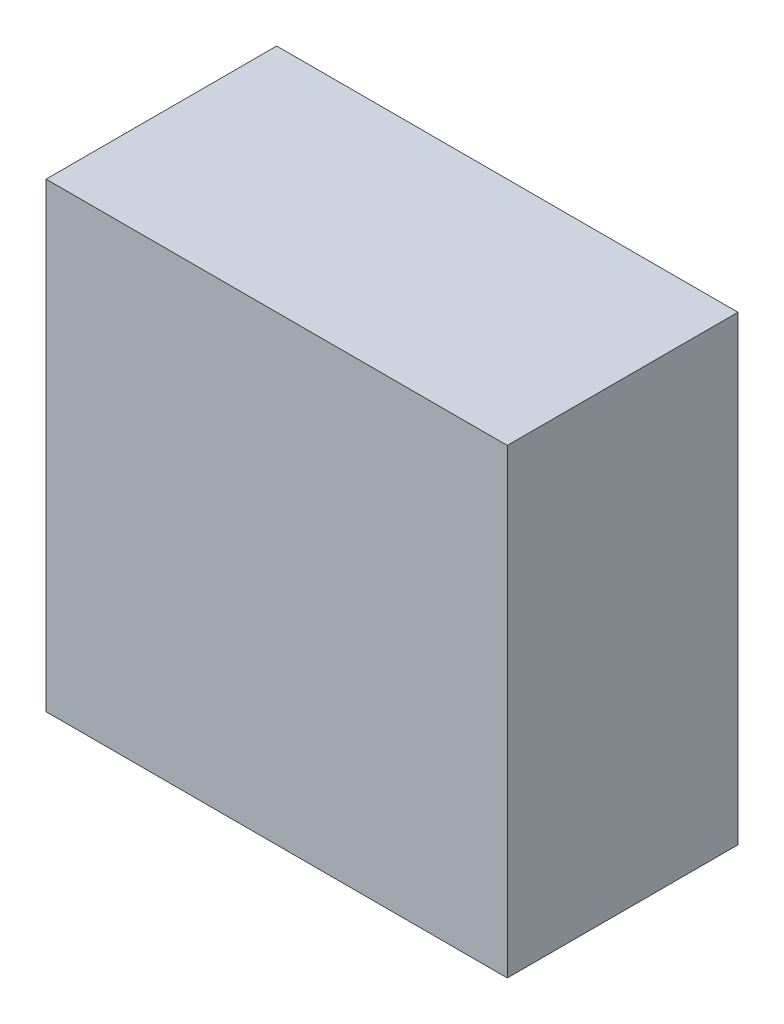
ISO-10303-21;
HEADER;
FILE_DESCRIPTION(('STEP AP214'),'2;1');
FILE_NAME('part.step','',(''),(''),'','','');
FILE_SCHEMA(('AUTOMOTIVE_DESIGN { 1 0 10303 214 1 1 1 1 }'));
ENDSEC;
DATA;
#1=APPLICATION_CONTEXT('core data for automotive mechanical design processes');
#2=APPLICATION_PROTOCOL_DEFINITION('international standard','automotive_design',2000,#1);
#3=PRODUCT_CONTEXT('',#1,'mechanical');
#4=PRODUCT('Part','Part','',(#3));
#5=PRODUCT_RELATED_PRODUCT_CATEGORY('part','',(#4));
#6=PRODUCT_DEFINITION_FORMATION('','',#4);
#7=PRODUCT_DEFINITION_CONTEXT('part definition',#1,'design');
#8=PRODUCT_DEFINITION('design','',#6,#7);
#9=PRODUCT_DEFINITION_SHAPE('','',#8);
#10=(LENGTH_UNIT() NAMED_UNIT(*) SI_UNIT(.MILLI.,.METRE.));
#11=(NAMED_UNIT(*) PLANE_ANGLE_UNIT() SI_UNIT($,.RADIAN.));
#12=(NAMED_UNIT(*) SI_UNIT($,.STERADIAN.) SOLID_ANGLE_UNIT());
#13=UNCERTAINTY_MEASURE_WITH_UNIT(LENGTH_MEASURE(1.E-05),#10,'distance_accuracy_value','');
#14=(GEOMETRIC_REPRESENTATION_CONTEXT(3) GLOBAL_UNCERTAINTY_ASSIGNED_CONTEXT((#13)) GLOBAL_UNIT_ASSIGNED_CONTEXT((#10,
#11,#12)) REPRESENTATION_CONTEXT('',''));
#15=CARTESIAN_POINT('',(0.,0.,0.));
#16=DIRECTION('',(0.,0.,1.));
#17=DIRECTION('',(1.,0.,0.));
#18=AXIS2_PLACEMENT_3D('',#15,#16,#17);
#19=CARTESIAN_POINT('',(-63.5,-63.5,0.));
#20=DIRECTION('',(0.,0.,-1.));
#21=DIRECTION('',(-1.,0.,0.));
#22=AXIS2_PLACEMENT_3D('',#19,#20,#21);
#23=PLANE('',#22);
#24=DIRECTION('',(0.,-1.,0.));
#25=VECTOR('',#24,1.);
#26=CARTESIAN_POINT('',(-63.5,63.5,0.));
#27=LINE('',#26,#25);
#28=CARTESIAN_POINT('',(-63.5,63.5,0.));
#29=VERTEX_POINT('',#28);
#30=CARTESIAN_POINT('',(-63.5,-63.5,0.));
#31=VERTEX_POINT('',#30);
#32=EDGE_CURVE('E97',#29,#31,#27,.T.);
#33=ORIENTED_EDGE('',*,*,#32,.F.);
#34=DIRECTION('',(-1.,0.,0.));
#35=VECTOR('',#34,1.);
#36=CARTESIAN_POINT('',(63.5,63.5,0.));
#37=LINE('',#36,#35);
#38=CARTESIAN_POINT('',(63.5,63.5,0.));
#39=VERTEX_POINT('',#38);
#40=EDGE_CURVE('E73',#39,#29,#37,.T.);
#41=ORIENTED_EDGE('',*,*,#40,.F.);
#42=DIRECTION('',(0.,1.,0.));
#43=VECTOR('',#42,1.);
#44=CARTESIAN_POINT('',(63.5,63.5,0.));
#45=LINE('',#44,#43);
#46=CARTESIAN_POINT('',(63.5,-63.5,0.));
#47=VERTEX_POINT('',#46);
#48=EDGE_CURVE('E67',#47,#39,#45,.T.);
#49=ORIENTED_EDGE('',*,*,#48,.F.);
#50=DIRECTION('',(1.,0.,0.));
#51=VECTOR('',#50,1.);
#52=CARTESIAN_POINT('',(63.5,-63.5,0.));
#53=LINE('',#52,#51);
#54=EDGE_CURVE('E89',#31,#47,#53,.T.);
#55=ORIENTED_EDGE('',*,*,#54,.F.);
#56=EDGE_LOOP('',(#33,#41,#49,#55));
#57=FACE_BOUND('',#56,.T.);
#58=CARTESIAN_POINT('',(0.,0.,0.));
#59=DIRECTION('',(0.,0.,-1.));
#60=DIRECTION('',(-1.,0.,0.));
#61=AXIS2_PLACEMENT_3D('',#58,#59,#60);
#62=CIRCLE('',#61,12.7);
#63=CARTESIAN_POINT('',(-12.7,0.,0.));
#64=VERTEX_POINT('',#63);
#65=EDGE_CURVE('E111',#64,#64,#62,.T.);
#66=ORIENTED_EDGE('',*,*,#65,.F.);
#67=EDGE_LOOP('',(#66));
#68=FACE_BOUND('',#67,.T.);
#69=ADVANCED_FACE('F33',(#57,#68),#23,.T.);
#70=CARTESIAN_POINT('',(-63.5,63.5,63.5));
#71=DIRECTION('',(1.,0.,0.));
#72=DIRECTION('',(0.,1.,0.));
#73=AXIS2_PLACEMENT_3D('',#70,#71,#72);
#74=PLANE('',#73);
#75=ORIENTED_EDGE('',*,*,#32,.T.);
#76=DIRECTION('',(0.,0.,-1.));
#77=VECTOR('',#76,1.);
#78=CARTESIAN_POINT('',(-63.5,-63.5,63.5));
#79=LINE('',#78,#77);
#80=CARTESIAN_POINT('',(-63.5,-63.5,63.5));
#81=VERTEX_POINT('',#80);
#82=EDGE_CURVE('E11',#81,#31,#79,.T.);
#83=ORIENTED_EDGE('',*,*,#82,.F.);
#84=DIRECTION('',(0.,-1.,0.));
#85=VECTOR('',#84,1.);
#86=CARTESIAN_POINT('',(-63.5,63.5,63.5));
#87=LINE('',#86,#85);
#88=CARTESIAN_POINT('',(-63.5,63.5,63.5));
#89=VERTEX_POINT('',#88);
#90=EDGE_CURVE('E85',#89,#81,#87,.T.);
#91=ORIENTED_EDGE('',*,*,#90,.F.);
#92=DIRECTION('',(0.,0.,-1.));
#93=VECTOR('',#92,1.);
#94=CARTESIAN_POINT('',(-63.5,63.5,63.5));
#95=LINE('',#94,#93);
#96=EDGE_CURVE('E93',#89,#29,#95,.T.);
#97=ORIENTED_EDGE('',*,*,#96,.T.);
#98=EDGE_LOOP('',(#75,#83,#91,#97));
#99=FACE_BOUND('',#98,.T.);
#100=ADVANCED_FACE('F35',(#99),#74,.F.);
#101=CARTESIAN_POINT('',(63.5,-63.5,63.5));
#102=DIRECTION('',(0.,1.,0.));
#103=DIRECTION('',(-1.,0.,0.));
#104=AXIS2_PLACEMENT_3D('',#101,#102,#103);
#105=PLANE('',#104);
#106=ORIENTED_EDGE('',*,*,#54,.T.);
#107=DIRECTION('',(0.,0.,-1.));
#108=VECTOR('',#107,1.);
#109=CARTESIAN_POINT('',(63.5,-63.5,63.5));
#110=LINE('',#109,#108);
#111=CARTESIAN_POINT('',(63.5,-63.5,63.5));
#112=VERTEX_POINT('',#111);
#113=EDGE_CURVE('E42',#112,#47,#110,.T.);
#114=ORIENTED_EDGE('',*,*,#113,.F.);
#115=DIRECTION('',(1.,0.,0.));
#116=VECTOR('',#115,1.);
#117=CARTESIAN_POINT('',(63.5,-63.5,63.5));
#118=LINE('',#117,#116);
#119=EDGE_CURVE('E80',#81,#112,#118,.T.);
#120=ORIENTED_EDGE('',*,*,#119,.F.);
#121=ORIENTED_EDGE('',*,*,#82,.T.);
#122=EDGE_LOOP('',(#106,#114,#120,#121));
#123=FACE_BOUND('',#122,.T.);
#124=ADVANCED_FACE('F88',(#123),#105,.F.);
#125=CARTESIAN_POINT('',(63.5,63.5,63.5));
#126=DIRECTION('',(-1.,0.,0.));
#127=DIRECTION('',(0.,0.,1.));
#128=AXIS2_PLACEMENT_3D('',#125,#126,#127);
#129=PLANE('',#128);
#130=ORIENTED_EDGE('',*,*,#48,.T.);
#131=DIRECTION('',(0.,0.,-1.));
#132=VECTOR('',#131,1.);
#133=CARTESIAN_POINT('',(63.5,63.5,63.5));
#134=LINE('',#133,#132);
#135=CARTESIAN_POINT('',(63.5,63.5,63.5));
#136=VERTEX_POINT('',#135);
#137=EDGE_CURVE('E90',#136,#39,#134,.T.);
#138=ORIENTED_EDGE('',*,*,#137,.F.);
#139=DIRECTION('',(0.,1.,0.));
#140=VECTOR('',#139,1.);
#141=CARTESIAN_POINT('',(63.5,63.5,63.5));
#142=LINE('',#141,#140);
#143=EDGE_CURVE('E83',#112,#136,#142,.T.);
#144=ORIENTED_EDGE('',*,*,#143,.F.);
#145=ORIENTED_EDGE('',*,*,#113,.T.);
#146=EDGE_LOOP('',(#130,#138,#144,#145));
#147=FACE_BOUND('',#146,.T.);
#148=ADVANCED_FACE('F91',(#147),#129,.F.);
#149=CARTESIAN_POINT('',(63.5,63.5,63.5));
#150=DIRECTION('',(0.,-1.,0.));
#151=DIRECTION('',(1.,0.,0.));
#152=AXIS2_PLACEMENT_3D('',#149,#150,#151);
#153=PLANE('',#152);
#154=ORIENTED_EDGE('',*,*,#40,.T.);
#155=ORIENTED_EDGE('',*,*,#96,.F.);
#156=DIRECTION('',(-1.,0.,0.));
#157=VECTOR('',#156,1.);
#158=CARTESIAN_POINT('',(63.5,63.5,63.5));
#159=LINE('',#158,#157);
#160=EDGE_CURVE('E50',#136,#89,#159,.T.);
#161=ORIENTED_EDGE('',*,*,#160,.F.);
#162=ORIENTED_EDGE('',*,*,#137,.T.);
#163=EDGE_LOOP('',(#154,#155,#161,#162));
#164=FACE_BOUND('',#163,.T.);
#165=ADVANCED_FACE('F105',(#164),#153,.F.);
#166=CARTESIAN_POINT('',(-63.5,-63.5,63.5));
#167=DIRECTION('',(0.,0.,-1.));
#168=DIRECTION('',(-1.,0.,0.));
#169=AXIS2_PLACEMENT_3D('',#166,#167,#168);
#170=PLANE('',#169);
#171=ORIENTED_EDGE('',*,*,#90,.T.);
#172=ORIENTED_EDGE('',*,*,#119,.T.);
#173=ORIENTED_EDGE('',*,*,#143,.T.);
#174=ORIENTED_EDGE('',*,*,#160,.T.);
#175=EDGE_LOOP('',(#171,#172,#173,#174));
#176=FACE_BOUND('',#175,.T.);
#177=ADVANCED_FACE('F81',(#176),#170,.F.);
#178=CARTESIAN_POINT('',(0.,0.,-50.8));
#179=DIRECTION('',(0.,0.,1.));
#180=DIRECTION('',(1.,0.,0.));
#181=AXIS2_PLACEMENT_3D('',#178,#179,#180);
#182=CYLINDRICAL_SURFACE('',#181,12.7);
#183=CARTESIAN_POINT('',(0.,0.,-50.8));
#184=DIRECTION('',(0.,0.,-1.));
#185=DIRECTION('',(-1.,0.,0.));
#186=AXIS2_PLACEMENT_3D('',#183,#184,#185);
#187=CIRCLE('',#186,12.7);
#188=CARTESIAN_POINT('',(-12.7,0.,-50.8));
#189=VERTEX_POINT('',#188);
#190=EDGE_CURVE('E100',#189,#189,#187,.T.);
#191=ORIENTED_EDGE('',*,*,#190,.F.);
#192=EDGE_LOOP('',(#191));
#193=FACE_BOUND('',#192,.T.);
#194=ORIENTED_EDGE('',*,*,#65,.T.);
#195=EDGE_LOOP('',(#194));
#196=FACE_BOUND('',#195,.T.);
#197=ADVANCED_FACE('F119',(#193,#196),#182,.T.);
#198=CARTESIAN_POINT('',(0.,0.,-50.8));
#199=DIRECTION('',(0.,0.,-1.));
#200=DIRECTION('',(-1.,0.,0.));
#201=AXIS2_PLACEMENT_3D('',#198,#199,#200);
#202=PLANE('',#201);
#203=ORIENTED_EDGE('',*,*,#190,.T.);
#204=EDGE_LOOP('',(#203));
#205=FACE_BOUND('',#204,.T.);
#206=ADVANCED_FACE('F117',(#205),#202,.T.);
#207=CLOSED_SHELL('',(#69,#100,#124,#148,#165,#177,#197,#206));
#208=MANIFOLD_SOLID_BREP('B2',#207);
#209=ADVANCED_BREP_SHAPE_REPRESENTATION('',(#18,#208),#14);
#210=SHAPE_DEFINITION_REPRESENTATION(#9,#209);
ENDSEC;
END-ISO-10303-21;
